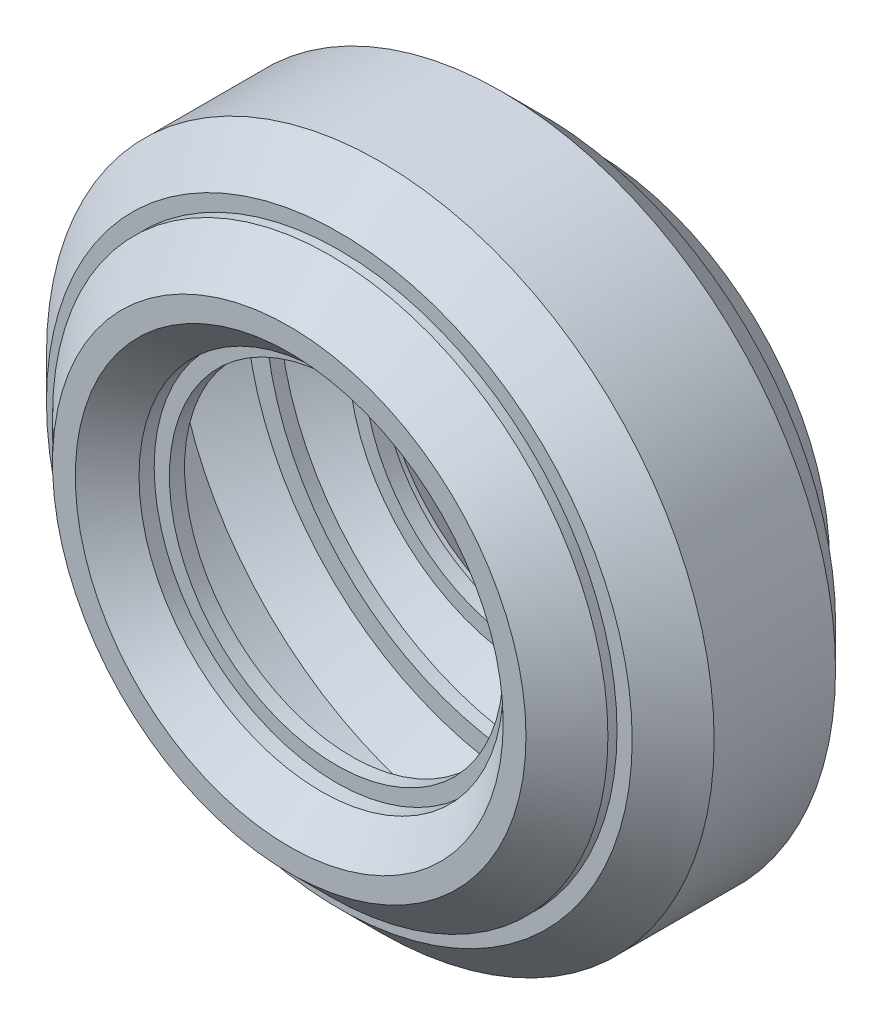
ISO-10303-21;
HEADER;
FILE_DESCRIPTION(('STEP AP214'),'2;1');
FILE_NAME('part.step','',(''),(''),'','','');
FILE_SCHEMA(('AUTOMOTIVE_DESIGN { 1 0 10303 214 1 1 1 1 }'));
ENDSEC;
DATA;
#1=APPLICATION_CONTEXT('core data for automotive mechanical design processes');
#2=APPLICATION_PROTOCOL_DEFINITION('international standard','automotive_design',2000,#1);
#3=PRODUCT_CONTEXT('',#1,'mechanical');
#4=PRODUCT('Part','Part','',(#3));
#5=PRODUCT_RELATED_PRODUCT_CATEGORY('part','',(#4));
#6=PRODUCT_DEFINITION_FORMATION('','',#4);
#7=PRODUCT_DEFINITION_CONTEXT('part definition',#1,'design');
#8=PRODUCT_DEFINITION('design','',#6,#7);
#9=PRODUCT_DEFINITION_SHAPE('','',#8);
#10=(LENGTH_UNIT() NAMED_UNIT(*) SI_UNIT(.MILLI.,.METRE.));
#11=(NAMED_UNIT(*) PLANE_ANGLE_UNIT() SI_UNIT($,.RADIAN.));
#12=(NAMED_UNIT(*) SI_UNIT($,.STERADIAN.) SOLID_ANGLE_UNIT());
#13=UNCERTAINTY_MEASURE_WITH_UNIT(LENGTH_MEASURE(1.E-05),#10,'distance_accuracy_value','');
#14=(GEOMETRIC_REPRESENTATION_CONTEXT(3) GLOBAL_UNCERTAINTY_ASSIGNED_CONTEXT((#13)) GLOBAL_UNIT_ASSIGNED_CONTEXT((#10,
#11,#12)) REPRESENTATION_CONTEXT('',''));
#15=CARTESIAN_POINT('',(0.,0.,0.));
#16=DIRECTION('',(0.,0.,1.));
#17=DIRECTION('',(1.,0.,0.));
#18=AXIS2_PLACEMENT_3D('',#15,#16,#17);
#19=CARTESIAN_POINT('',(21.59,0.,8.763));
#20=DIRECTION('',(0.,0.,1.));
#21=DIRECTION('',(1.,0.,0.));
#22=AXIS2_PLACEMENT_3D('',#19,#20,#21);
#23=PLANE('',#22);
#24=CARTESIAN_POINT('',(7.62,0.,8.763));
#25=DIRECTION('',(0.,0.,1.));
#26=DIRECTION('',(1.,0.,0.));
#27=AXIS2_PLACEMENT_3D('',#24,#25,#26);
#28=CIRCLE('',#27,15.24);
#29=CARTESIAN_POINT('',(22.86,0.,8.763));
#30=VERTEX_POINT('',#29);
#31=EDGE_CURVE('E53',#30,#30,#28,.T.);
#32=ORIENTED_EDGE('',*,*,#31,.T.);
#33=EDGE_LOOP('',(#32));
#34=FACE_BOUND('',#33,.T.);
#35=CARTESIAN_POINT('',(7.62,0.,8.763));
#36=DIRECTION('',(0.,0.,1.));
#37=DIRECTION('',(1.,0.,0.));
#38=AXIS2_PLACEMENT_3D('',#35,#36,#37);
#39=CIRCLE('',#38,13.97);
#40=CARTESIAN_POINT('',(21.59,0.,8.763));
#41=VERTEX_POINT('',#40);
#42=EDGE_CURVE('E11',#41,#41,#39,.T.);
#43=ORIENTED_EDGE('',*,*,#42,.F.);
#44=EDGE_LOOP('',(#43));
#45=FACE_BOUND('',#44,.T.);
#46=ADVANCED_FACE('F33',(#34,#45),#23,.T.);
#47=CARTESIAN_POINT('',(7.62,0.,0.));
#48=DIRECTION('',(0.,0.,1.));
#49=DIRECTION('',(1.,0.,0.));
#50=AXIS2_PLACEMENT_3D('',#47,#48,#49);
#51=CYLINDRICAL_SURFACE('',#50,13.97);
#52=ORIENTED_EDGE('',*,*,#42,.T.);
#53=EDGE_LOOP('',(#52));
#54=FACE_BOUND('',#53,.T.);
#55=CARTESIAN_POINT('',(7.62,0.,7.493));
#56=DIRECTION('',(0.,0.,1.));
#57=DIRECTION('',(1.,0.,0.));
#58=AXIS2_PLACEMENT_3D('',#55,#56,#57);
#59=CIRCLE('',#58,13.97);
#60=CARTESIAN_POINT('',(21.59,0.,7.493));
#61=VERTEX_POINT('',#60);
#62=EDGE_CURVE('E39',#61,#61,#59,.T.);
#63=ORIENTED_EDGE('',*,*,#62,.F.);
#64=EDGE_LOOP('',(#63));
#65=FACE_BOUND('',#64,.T.);
#66=ADVANCED_FACE('F181',(#54,#65),#51,.F.);
#67=CARTESIAN_POINT('',(22.86,0.,7.493));
#68=DIRECTION('',(0.,0.,-1.));
#69=DIRECTION('',(-1.,0.,0.));
#70=AXIS2_PLACEMENT_3D('',#67,#68,#69);
#71=PLANE('',#70);
#72=ORIENTED_EDGE('',*,*,#62,.T.);
#73=EDGE_LOOP('',(#72));
#74=FACE_BOUND('',#73,.T.);
#75=CARTESIAN_POINT('',(7.62,0.,7.493));
#76=DIRECTION('',(0.,0.,1.));
#77=DIRECTION('',(1.,0.,0.));
#78=AXIS2_PLACEMENT_3D('',#75,#76,#77);
#79=CIRCLE('',#78,15.24);
#80=CARTESIAN_POINT('',(22.86,0.,7.493));
#81=VERTEX_POINT('',#80);
#82=EDGE_CURVE('E50',#81,#81,#79,.T.);
#83=ORIENTED_EDGE('',*,*,#82,.F.);
#84=EDGE_LOOP('',(#83));
#85=FACE_BOUND('',#84,.T.);
#86=ADVANCED_FACE('F186',(#74,#85),#71,.T.);
#87=CARTESIAN_POINT('',(21.59,0.,-7.493));
#88=DIRECTION('',(0.,0.,1.));
#89=DIRECTION('',(1.,0.,0.));
#90=AXIS2_PLACEMENT_3D('',#87,#88,#89);
#91=PLANE('',#90);
#92=CARTESIAN_POINT('',(7.62,0.,-7.493));
#93=DIRECTION('',(0.,0.,1.));
#94=DIRECTION('',(1.,0.,0.));
#95=AXIS2_PLACEMENT_3D('',#92,#93,#94);
#96=CIRCLE('',#95,15.24);
#97=CARTESIAN_POINT('',(22.86,0.,-7.493));
#98=VERTEX_POINT('',#97);
#99=EDGE_CURVE('E54',#98,#98,#96,.T.);
#100=ORIENTED_EDGE('',*,*,#99,.T.);
#101=EDGE_LOOP('',(#100));
#102=FACE_BOUND('',#101,.T.);
#103=CARTESIAN_POINT('',(7.62,0.,-7.493));
#104=DIRECTION('',(0.,0.,1.));
#105=DIRECTION('',(1.,0.,0.));
#106=AXIS2_PLACEMENT_3D('',#103,#104,#105);
#107=CIRCLE('',#106,13.97);
#108=CARTESIAN_POINT('',(21.59,0.,-7.493));
#109=VERTEX_POINT('',#108);
#110=EDGE_CURVE('E43',#109,#109,#107,.T.);
#111=ORIENTED_EDGE('',*,*,#110,.F.);
#112=EDGE_LOOP('',(#111));
#113=FACE_BOUND('',#112,.T.);
#114=ADVANCED_FACE('F261',(#102,#113),#91,.T.);
#115=CARTESIAN_POINT('',(7.62,0.,0.));
#116=DIRECTION('',(0.,0.,1.));
#117=DIRECTION('',(1.,0.,0.));
#118=AXIS2_PLACEMENT_3D('',#115,#116,#117);
#119=CYLINDRICAL_SURFACE('',#118,13.97);
#120=ORIENTED_EDGE('',*,*,#110,.T.);
#121=EDGE_LOOP('',(#120));
#122=FACE_BOUND('',#121,.T.);
#123=CARTESIAN_POINT('',(7.62,0.,-8.763));
#124=DIRECTION('',(0.,0.,1.));
#125=DIRECTION('',(1.,0.,0.));
#126=AXIS2_PLACEMENT_3D('',#123,#124,#125);
#127=CIRCLE('',#126,13.97);
#128=CARTESIAN_POINT('',(21.59,0.,-8.763));
#129=VERTEX_POINT('',#128);
#130=EDGE_CURVE('E47',#129,#129,#127,.T.);
#131=ORIENTED_EDGE('',*,*,#130,.F.);
#132=EDGE_LOOP('',(#131));
#133=FACE_BOUND('',#132,.T.);
#134=ADVANCED_FACE('F257',(#122,#133),#119,.F.);
#135=CARTESIAN_POINT('',(22.86,0.,-8.763));
#136=DIRECTION('',(0.,0.,-1.));
#137=DIRECTION('',(-1.,0.,0.));
#138=AXIS2_PLACEMENT_3D('',#135,#136,#137);
#139=PLANE('',#138);
#140=ORIENTED_EDGE('',*,*,#130,.T.);
#141=EDGE_LOOP('',(#140));
#142=FACE_BOUND('',#141,.T.);
#143=CARTESIAN_POINT('',(7.62,0.,-8.763));
#144=DIRECTION('',(0.,0.,1.));
#145=DIRECTION('',(1.,0.,0.));
#146=AXIS2_PLACEMENT_3D('',#143,#144,#145);
#147=CIRCLE('',#146,15.24);
#148=CARTESIAN_POINT('',(22.86,0.,-8.763));
#149=VERTEX_POINT('',#148);
#150=EDGE_CURVE('E60',#149,#149,#147,.T.);
#151=ORIENTED_EDGE('',*,*,#150,.F.);
#152=EDGE_LOOP('',(#151));
#153=FACE_BOUND('',#152,.T.);
#154=ADVANCED_FACE('F253',(#142,#153),#139,.T.);
#155=CARTESIAN_POINT('',(7.62,0.,0.));
#156=DIRECTION('',(0.,0.,1.));
#157=DIRECTION('',(1.,0.,0.));
#158=AXIS2_PLACEMENT_3D('',#155,#156,#157);
#159=CYLINDRICAL_SURFACE('',#158,15.24);
#160=ORIENTED_EDGE('',*,*,#150,.T.);
#161=EDGE_LOOP('',(#160));
#162=FACE_BOUND('',#161,.T.);
#163=CARTESIAN_POINT('',(7.62,0.,-10.033));
#164=DIRECTION('',(0.,0.,1.));
#165=DIRECTION('',(1.,0.,0.));
#166=AXIS2_PLACEMENT_3D('',#163,#164,#165);
#167=CIRCLE('',#166,15.24);
#168=CARTESIAN_POINT('',(22.86,0.,-10.033));
#169=VERTEX_POINT('',#168);
#170=EDGE_CURVE('E63',#169,#169,#167,.T.);
#171=ORIENTED_EDGE('',*,*,#170,.F.);
#172=EDGE_LOOP('',(#171));
#173=FACE_BOUND('',#172,.T.);
#174=ADVANCED_FACE('F249',(#162,#173),#159,.F.);
#175=CARTESIAN_POINT('',(7.62,0.,-12.7));
#176=DIRECTION('',(0.,0.,-1.));
#177=DIRECTION('',(-1.,0.,0.));
#178=AXIS2_PLACEMENT_3D('',#175,#176,#177);
#179=CONICAL_SURFACE('',#178,17.9069999999999,0.785398163397436);
#180=ORIENTED_EDGE('',*,*,#170,.T.);
#181=EDGE_LOOP('',(#180));
#182=FACE_BOUND('',#181,.T.);
#183=CARTESIAN_POINT('',(7.62,0.,-12.7));
#184=DIRECTION('',(0.,0.,1.));
#185=DIRECTION('',(1.,0.,0.));
#186=AXIS2_PLACEMENT_3D('',#183,#184,#185);
#187=CIRCLE('',#186,17.9069999999999);
#188=CARTESIAN_POINT('',(25.5269999999999,0.,-12.7));
#189=VERTEX_POINT('',#188);
#190=EDGE_CURVE('E66',#189,#189,#187,.T.);
#191=ORIENTED_EDGE('',*,*,#190,.F.);
#192=EDGE_LOOP('',(#191));
#193=FACE_BOUND('',#192,.T.);
#194=ADVANCED_FACE('F245',(#182,#193),#179,.F.);
#195=CARTESIAN_POINT('',(25.5269999999999,0.,-12.7));
#196=DIRECTION('',(0.,0.,-1.));
#197=DIRECTION('',(-1.,0.,0.));
#198=AXIS2_PLACEMENT_3D('',#195,#196,#197);
#199=PLANE('',#198);
#200=ORIENTED_EDGE('',*,*,#190,.T.);
#201=EDGE_LOOP('',(#200));
#202=FACE_BOUND('',#201,.T.);
#203=CARTESIAN_POINT('',(7.62,0.,-12.7));
#204=DIRECTION('',(0.,0.,1.));
#205=DIRECTION('',(1.,0.,0.));
#206=AXIS2_PLACEMENT_3D('',#203,#204,#205);
#207=CIRCLE('',#206,19.8119999999999);
#208=CARTESIAN_POINT('',(27.4319999999999,0.,-12.7));
#209=VERTEX_POINT('',#208);
#210=EDGE_CURVE('E69',#209,#209,#207,.T.);
#211=ORIENTED_EDGE('',*,*,#210,.F.);
#212=EDGE_LOOP('',(#211));
#213=FACE_BOUND('',#212,.T.);
#214=ADVANCED_FACE('F241',(#202,#213),#199,.T.);
#215=CARTESIAN_POINT('',(7.62,0.,-9.27099999999992));
#216=DIRECTION('',(0.,0.,1.));
#217=DIRECTION('',(1.,0.,0.));
#218=AXIS2_PLACEMENT_3D('',#215,#216,#217);
#219=CONICAL_SURFACE('',#218,23.2409999999999,0.785398163397437);
#220=ORIENTED_EDGE('',*,*,#210,.T.);
#221=EDGE_LOOP('',(#220));
#222=FACE_BOUND('',#221,.T.);
#223=CARTESIAN_POINT('',(7.62,0.,-9.27099999999992));
#224=DIRECTION('',(0.,0.,1.));
#225=DIRECTION('',(1.,0.,0.));
#226=AXIS2_PLACEMENT_3D('',#223,#224,#225);
#227=CIRCLE('',#226,23.2409999999999);
#228=CARTESIAN_POINT('',(30.8609999999999,0.,-9.27099999999992));
#229=VERTEX_POINT('',#228);
#230=EDGE_CURVE('E72',#229,#229,#227,.T.);
#231=ORIENTED_EDGE('',*,*,#230,.F.);
#232=EDGE_LOOP('',(#231));
#233=FACE_BOUND('',#232,.T.);
#234=ADVANCED_FACE('F237',(#222,#233),#219,.T.);
#235=CARTESIAN_POINT('',(7.62,0.,0.));
#236=DIRECTION('',(0.,0.,1.));
#237=DIRECTION('',(1.,0.,0.));
#238=AXIS2_PLACEMENT_3D('',#235,#236,#237);
#239=CYLINDRICAL_SURFACE('',#238,23.2409999999999);
#240=ORIENTED_EDGE('',*,*,#230,.T.);
#241=EDGE_LOOP('',(#240));
#242=FACE_BOUND('',#241,.T.);
#243=CARTESIAN_POINT('',(7.62,0.,-8.50899999999999));
#244=DIRECTION('',(0.,0.,1.));
#245=DIRECTION('',(1.,0.,0.));
#246=AXIS2_PLACEMENT_3D('',#243,#244,#245);
#247=CIRCLE('',#246,23.2409999999999);
#248=CARTESIAN_POINT('',(30.8609999999999,0.,-8.50899999999999));
#249=VERTEX_POINT('',#248);
#250=EDGE_CURVE('E75',#249,#249,#247,.T.);
#251=ORIENTED_EDGE('',*,*,#250,.F.);
#252=EDGE_LOOP('',(#251));
#253=FACE_BOUND('',#252,.T.);
#254=ADVANCED_FACE('F233',(#242,#253),#239,.T.);
#255=CARTESIAN_POINT('',(30.8609999999999,0.,-8.50899999999999));
#256=DIRECTION('',(0.,0.,-1.));
#257=DIRECTION('',(-1.,0.,0.));
#258=AXIS2_PLACEMENT_3D('',#255,#256,#257);
#259=PLANE('',#258);
#260=ORIENTED_EDGE('',*,*,#250,.T.);
#261=EDGE_LOOP('',(#260));
#262=FACE_BOUND('',#261,.T.);
#263=CARTESIAN_POINT('',(7.62,0.,-8.50899999999999));
#264=DIRECTION('',(0.,0.,1.));
#265=DIRECTION('',(1.,0.,0.));
#266=AXIS2_PLACEMENT_3D('',#263,#264,#265);
#267=CIRCLE('',#266,24.5109999999999);
#268=CARTESIAN_POINT('',(32.1309999999999,0.,-8.50899999999999));
#269=VERTEX_POINT('',#268);
#270=EDGE_CURVE('E78',#269,#269,#267,.T.);
#271=ORIENTED_EDGE('',*,*,#270,.F.);
#272=EDGE_LOOP('',(#271));
#273=FACE_BOUND('',#272,.T.);
#274=ADVANCED_FACE('F229',(#262,#273),#259,.T.);
#275=CARTESIAN_POINT('',(7.62,0.,-5.08));
#276=DIRECTION('',(0.,0.,1.));
#277=DIRECTION('',(1.,0.,0.));
#278=AXIS2_PLACEMENT_3D('',#275,#276,#277);
#279=CONICAL_SURFACE('',#278,27.94,0.785398163397461);
#280=ORIENTED_EDGE('',*,*,#270,.T.);
#281=EDGE_LOOP('',(#280));
#282=FACE_BOUND('',#281,.T.);
#283=CARTESIAN_POINT('',(7.62,0.,-5.08));
#284=DIRECTION('',(0.,0.,1.));
#285=DIRECTION('',(1.,0.,0.));
#286=AXIS2_PLACEMENT_3D('',#283,#284,#285);
#287=CIRCLE('',#286,27.94);
#288=CARTESIAN_POINT('',(35.56,0.,-5.08));
#289=VERTEX_POINT('',#288);
#290=EDGE_CURVE('E81',#289,#289,#287,.T.);
#291=ORIENTED_EDGE('',*,*,#290,.F.);
#292=EDGE_LOOP('',(#291));
#293=FACE_BOUND('',#292,.T.);
#294=ADVANCED_FACE('F225',(#282,#293),#279,.T.);
#295=CARTESIAN_POINT('',(7.62,0.,0.));
#296=DIRECTION('',(0.,0.,1.));
#297=DIRECTION('',(1.,0.,0.));
#298=AXIS2_PLACEMENT_3D('',#295,#296,#297);
#299=CYLINDRICAL_SURFACE('',#298,27.94);
#300=ORIENTED_EDGE('',*,*,#290,.T.);
#301=EDGE_LOOP('',(#300));
#302=FACE_BOUND('',#301,.T.);
#303=CARTESIAN_POINT('',(7.62,0.,5.08));
#304=DIRECTION('',(0.,0.,1.));
#305=DIRECTION('',(1.,0.,0.));
#306=AXIS2_PLACEMENT_3D('',#303,#304,#305);
#307=CIRCLE('',#306,27.94);
#308=CARTESIAN_POINT('',(35.56,0.,5.08));
#309=VERTEX_POINT('',#308);
#310=EDGE_CURVE('E84',#309,#309,#307,.T.);
#311=ORIENTED_EDGE('',*,*,#310,.F.);
#312=EDGE_LOOP('',(#311));
#313=FACE_BOUND('',#312,.T.);
#314=ADVANCED_FACE('F221',(#302,#313),#299,.T.);
#315=CARTESIAN_POINT('',(7.62,0.,8.50899999999999));
#316=DIRECTION('',(0.,0.,-1.));
#317=DIRECTION('',(-1.,0.,0.));
#318=AXIS2_PLACEMENT_3D('',#315,#316,#317);
#319=CONICAL_SURFACE('',#318,24.5109999999999,0.78539816339746);
#320=ORIENTED_EDGE('',*,*,#310,.T.);
#321=EDGE_LOOP('',(#320));
#322=FACE_BOUND('',#321,.T.);
#323=CARTESIAN_POINT('',(7.62,0.,8.50899999999999));
#324=DIRECTION('',(0.,0.,1.));
#325=DIRECTION('',(1.,0.,0.));
#326=AXIS2_PLACEMENT_3D('',#323,#324,#325);
#327=CIRCLE('',#326,24.5109999999999);
#328=CARTESIAN_POINT('',(32.1309999999999,0.,8.50899999999999));
#329=VERTEX_POINT('',#328);
#330=EDGE_CURVE('E87',#329,#329,#327,.T.);
#331=ORIENTED_EDGE('',*,*,#330,.F.);
#332=EDGE_LOOP('',(#331));
#333=FACE_BOUND('',#332,.T.);
#334=ADVANCED_FACE('F217',(#322,#333),#319,.T.);
#335=CARTESIAN_POINT('',(32.1309999999999,0.,8.50899999999999));
#336=DIRECTION('',(0.,0.,1.));
#337=DIRECTION('',(1.,0.,0.));
#338=AXIS2_PLACEMENT_3D('',#335,#336,#337);
#339=PLANE('',#338);
#340=ORIENTED_EDGE('',*,*,#330,.T.);
#341=EDGE_LOOP('',(#340));
#342=FACE_BOUND('',#341,.T.);
#343=CARTESIAN_POINT('',(7.62,0.,8.50899999999999));
#344=DIRECTION('',(0.,0.,1.));
#345=DIRECTION('',(1.,0.,0.));
#346=AXIS2_PLACEMENT_3D('',#343,#344,#345);
#347=CIRCLE('',#346,23.2409999999999);
#348=CARTESIAN_POINT('',(30.8609999999999,0.,8.50899999999999));
#349=VERTEX_POINT('',#348);
#350=EDGE_CURVE('E90',#349,#349,#347,.T.);
#351=ORIENTED_EDGE('',*,*,#350,.F.);
#352=EDGE_LOOP('',(#351));
#353=FACE_BOUND('',#352,.T.);
#354=ADVANCED_FACE('F213',(#342,#353),#339,.T.);
#355=CARTESIAN_POINT('',(7.62,0.,0.));
#356=DIRECTION('',(0.,0.,1.));
#357=DIRECTION('',(1.,0.,0.));
#358=AXIS2_PLACEMENT_3D('',#355,#356,#357);
#359=CYLINDRICAL_SURFACE('',#358,23.2409999999999);
#360=ORIENTED_EDGE('',*,*,#350,.T.);
#361=EDGE_LOOP('',(#360));
#362=FACE_BOUND('',#361,.T.);
#363=CARTESIAN_POINT('',(7.62,0.,9.27099999999992));
#364=DIRECTION('',(0.,0.,1.));
#365=DIRECTION('',(1.,0.,0.));
#366=AXIS2_PLACEMENT_3D('',#363,#364,#365);
#367=CIRCLE('',#366,23.2409999999999);
#368=CARTESIAN_POINT('',(30.8609999999999,0.,9.27099999999992));
#369=VERTEX_POINT('',#368);
#370=EDGE_CURVE('E93',#369,#369,#367,.T.);
#371=ORIENTED_EDGE('',*,*,#370,.F.);
#372=EDGE_LOOP('',(#371));
#373=FACE_BOUND('',#372,.T.);
#374=ADVANCED_FACE('F209',(#362,#373),#359,.T.);
#375=CARTESIAN_POINT('',(7.62,0.,12.7));
#376=DIRECTION('',(0.,0.,-1.));
#377=DIRECTION('',(-1.,0.,0.));
#378=AXIS2_PLACEMENT_3D('',#375,#376,#377);
#379=CONICAL_SURFACE('',#378,19.8119999999999,0.785398163397437);
#380=ORIENTED_EDGE('',*,*,#370,.T.);
#381=EDGE_LOOP('',(#380));
#382=FACE_BOUND('',#381,.T.);
#383=CARTESIAN_POINT('',(7.62,0.,12.7));
#384=DIRECTION('',(0.,0.,1.));
#385=DIRECTION('',(1.,0.,0.));
#386=AXIS2_PLACEMENT_3D('',#383,#384,#385);
#387=CIRCLE('',#386,19.8119999999999);
#388=CARTESIAN_POINT('',(27.4319999999999,0.,12.7));
#389=VERTEX_POINT('',#388);
#390=EDGE_CURVE('E96',#389,#389,#387,.T.);
#391=ORIENTED_EDGE('',*,*,#390,.F.);
#392=EDGE_LOOP('',(#391));
#393=FACE_BOUND('',#392,.T.);
#394=ADVANCED_FACE('F205',(#382,#393),#379,.T.);
#395=CARTESIAN_POINT('',(27.4319999999999,0.,12.7));
#396=DIRECTION('',(0.,0.,1.));
#397=DIRECTION('',(1.,0.,0.));
#398=AXIS2_PLACEMENT_3D('',#395,#396,#397);
#399=PLANE('',#398);
#400=ORIENTED_EDGE('',*,*,#390,.T.);
#401=EDGE_LOOP('',(#400));
#402=FACE_BOUND('',#401,.T.);
#403=CARTESIAN_POINT('',(7.62,0.,12.7));
#404=DIRECTION('',(0.,0.,1.));
#405=DIRECTION('',(1.,0.,0.));
#406=AXIS2_PLACEMENT_3D('',#403,#404,#405);
#407=CIRCLE('',#406,17.907);
#408=CARTESIAN_POINT('',(25.527,0.,12.7));
#409=VERTEX_POINT('',#408);
#410=EDGE_CURVE('E99',#409,#409,#407,.T.);
#411=ORIENTED_EDGE('',*,*,#410,.F.);
#412=EDGE_LOOP('',(#411));
#413=FACE_BOUND('',#412,.T.);
#414=ADVANCED_FACE('F197',(#402,#413),#399,.T.);
#415=CARTESIAN_POINT('',(7.62,0.,10.033));
#416=DIRECTION('',(0.,0.,1.));
#417=DIRECTION('',(1.,0.,0.));
#418=AXIS2_PLACEMENT_3D('',#415,#416,#417);
#419=CONICAL_SURFACE('',#418,15.24,0.785398163397443);
#420=ORIENTED_EDGE('',*,*,#410,.T.);
#421=EDGE_LOOP('',(#420));
#422=FACE_BOUND('',#421,.T.);
#423=CARTESIAN_POINT('',(7.62,0.,10.033));
#424=DIRECTION('',(0.,0.,1.));
#425=DIRECTION('',(1.,0.,0.));
#426=AXIS2_PLACEMENT_3D('',#423,#424,#425);
#427=CIRCLE('',#426,15.24);
#428=CARTESIAN_POINT('',(22.86,0.,10.033));
#429=VERTEX_POINT('',#428);
#430=EDGE_CURVE('E102',#429,#429,#427,.T.);
#431=ORIENTED_EDGE('',*,*,#430,.F.);
#432=EDGE_LOOP('',(#431));
#433=FACE_BOUND('',#432,.T.);
#434=ADVANCED_FACE('F191',(#422,#433),#419,.F.);
#435=CARTESIAN_POINT('',(7.62,0.,0.));
#436=DIRECTION('',(0.,0.,1.));
#437=DIRECTION('',(1.,0.,0.));
#438=AXIS2_PLACEMENT_3D('',#435,#436,#437);
#439=CYLINDRICAL_SURFACE('',#438,15.24);
#440=ORIENTED_EDGE('',*,*,#430,.T.);
#441=EDGE_LOOP('',(#440));
#442=FACE_BOUND('',#441,.T.);
#443=ORIENTED_EDGE('',*,*,#31,.F.);
#444=EDGE_LOOP('',(#443));
#445=FACE_BOUND('',#444,.T.);
#446=ADVANCED_FACE('F176',(#442,#445),#439,.F.);
#447=CARTESIAN_POINT('',(7.62,0.,0.));
#448=DIRECTION('',(0.,0.,1.));
#449=DIRECTION('',(1.,0.,0.));
#450=AXIS2_PLACEMENT_3D('',#447,#448,#449);
#451=CYLINDRICAL_SURFACE('',#450,15.24);
#452=CARTESIAN_POINT('',(7.62,0.,-8.128));
#453=DIRECTION('',(0.,0.,1.));
#454=DIRECTION('',(1.,0.,0.));
#455=AXIS2_PLACEMENT_3D('',#452,#453,#454);
#456=CIRCLE('',#455,15.24);
#457=CARTESIAN_POINT('',(22.86,0.,-8.128));
#458=VERTEX_POINT('',#457);
#459=EDGE_CURVE('E107',#458,#458,#456,.T.);
#460=ORIENTED_EDGE('',*,*,#459,.T.);
#461=EDGE_LOOP('',(#460));
#462=FACE_BOUND('',#461,.T.);
#463=ORIENTED_EDGE('',*,*,#99,.F.);
#464=EDGE_LOOP('',(#463));
#465=FACE_BOUND('',#464,.T.);
#466=ADVANCED_FACE('F166',(#462,#465),#451,.T.);
#467=CARTESIAN_POINT('',(21.59,0.,8.128));
#468=DIRECTION('',(0.,0.,1.));
#469=DIRECTION('',(1.,0.,0.));
#470=AXIS2_PLACEMENT_3D('',#467,#468,#469);
#471=PLANE('',#470);
#472=CARTESIAN_POINT('',(7.62,0.,8.128));
#473=DIRECTION('',(0.,0.,-1.));
#474=DIRECTION('',(-1.,0.,0.));
#475=AXIS2_PLACEMENT_3D('',#472,#473,#474);
#476=CIRCLE('',#475,15.24);
#477=CARTESIAN_POINT('',(-7.62,0.,8.128));
#478=VERTEX_POINT('',#477);
#479=EDGE_CURVE('E56',#478,#478,#476,.F.);
#480=ORIENTED_EDGE('',*,*,#479,.T.);
#481=EDGE_LOOP('',(#480));
#482=FACE_BOUND('',#481,.T.);
#483=CARTESIAN_POINT('',(7.62,0.,8.128));
#484=DIRECTION('',(0.,0.,1.));
#485=DIRECTION('',(1.,0.,0.));
#486=AXIS2_PLACEMENT_3D('',#483,#484,#485);
#487=CIRCLE('',#486,15.875);
#488=CARTESIAN_POINT('',(23.495,0.,8.128));
#489=VERTEX_POINT('',#488);
#490=EDGE_CURVE('E157',#489,#489,#487,.T.);
#491=ORIENTED_EDGE('',*,*,#490,.F.);
#492=EDGE_LOOP('',(#491));
#493=FACE_BOUND('',#492,.T.);
#494=ADVANCED_FACE('F163',(#482,#493),#471,.F.);
#495=CARTESIAN_POINT('',(7.62,0.,0.));
#496=DIRECTION('',(0.,0.,1.));
#497=DIRECTION('',(1.,0.,0.));
#498=AXIS2_PLACEMENT_3D('',#495,#496,#497);
#499=CYLINDRICAL_SURFACE('',#498,15.24);
#500=ORIENTED_EDGE('',*,*,#82,.T.);
#501=EDGE_LOOP('',(#500));
#502=FACE_BOUND('',#501,.T.);
#503=ORIENTED_EDGE('',*,*,#479,.F.);
#504=EDGE_LOOP('',(#503));
#505=FACE_BOUND('',#504,.T.);
#506=ADVANCED_FACE('F165',(#502,#505),#499,.T.);
#507=CARTESIAN_POINT('',(22.86,0.,-8.128));
#508=DIRECTION('',(0.,0.,-1.));
#509=DIRECTION('',(-1.,0.,0.));
#510=AXIS2_PLACEMENT_3D('',#507,#508,#509);
#511=PLANE('',#510);
#512=ORIENTED_EDGE('',*,*,#459,.F.);
#513=EDGE_LOOP('',(#512));
#514=FACE_BOUND('',#513,.T.);
#515=CARTESIAN_POINT('',(7.62,0.,-8.128));
#516=DIRECTION('',(0.,0.,-1.));
#517=DIRECTION('',(-1.,0.,0.));
#518=AXIS2_PLACEMENT_3D('',#515,#516,#517);
#519=CIRCLE('',#518,15.875);
#520=CARTESIAN_POINT('',(-8.255,0.,-8.128));
#521=VERTEX_POINT('',#520);
#522=EDGE_CURVE('E110',#521,#521,#519,.F.);
#523=ORIENTED_EDGE('',*,*,#522,.T.);
#524=EDGE_LOOP('',(#523));
#525=FACE_BOUND('',#524,.T.);
#526=ADVANCED_FACE('F173',(#514,#525),#511,.F.);
#527=CARTESIAN_POINT('',(7.62,0.,0.));
#528=DIRECTION('',(0.,0.,1.));
#529=DIRECTION('',(1.,0.,0.));
#530=AXIS2_PLACEMENT_3D('',#527,#528,#529);
#531=CYLINDRICAL_SURFACE('',#530,15.875);
#532=ORIENTED_EDGE('',*,*,#522,.F.);
#533=EDGE_LOOP('',(#532));
#534=FACE_BOUND('',#533,.T.);
#535=CARTESIAN_POINT('',(7.62,0.,-9.76997438789309));
#536=DIRECTION('',(0.,0.,-1.));
#537=DIRECTION('',(-1.,0.,0.));
#538=AXIS2_PLACEMENT_3D('',#535,#536,#537);
#539=CIRCLE('',#538,15.875);
#540=CARTESIAN_POINT('',(-8.255,0.,-9.76997438789309));
#541=VERTEX_POINT('',#540);
#542=EDGE_CURVE('E115',#541,#541,#539,.F.);
#543=ORIENTED_EDGE('',*,*,#542,.T.);
#544=EDGE_LOOP('',(#543));
#545=FACE_BOUND('',#544,.T.);
#546=ADVANCED_FACE('F372',(#534,#545),#531,.T.);
#547=CARTESIAN_POINT('',(7.62,0.,-12.2509871939465));
#548=DIRECTION('',(0.,0.,-1.));
#549=DIRECTION('',(-1.,0.,0.));
#550=AXIS2_PLACEMENT_3D('',#547,#548,#549);
#551=CONICAL_SURFACE('',#550,18.3560128060534,0.785398163397436);
#552=ORIENTED_EDGE('',*,*,#542,.F.);
#553=EDGE_LOOP('',(#552));
#554=FACE_BOUND('',#553,.T.);
#555=CARTESIAN_POINT('',(7.62,0.,-12.065));
#556=DIRECTION('',(0.,0.,-1.));
#557=DIRECTION('',(-1.,0.,0.));
#558=AXIS2_PLACEMENT_3D('',#555,#556,#557);
#559=CIRCLE('',#558,18.1700256121068);
#560=CARTESIAN_POINT('',(-10.5500256121068,0.,-12.065));
#561=VERTEX_POINT('',#560);
#562=EDGE_CURVE('E118',#561,#561,#559,.F.);
#563=ORIENTED_EDGE('',*,*,#562,.T.);
#564=EDGE_LOOP('',(#563));
#565=FACE_BOUND('',#564,.T.);
#566=ADVANCED_FACE('F381',(#554,#565),#551,.T.);
#567=CARTESIAN_POINT('',(25.5269999999999,0.,-12.065));
#568=DIRECTION('',(0.,0.,-1.));
#569=DIRECTION('',(-1.,0.,0.));
#570=AXIS2_PLACEMENT_3D('',#567,#568,#569);
#571=PLANE('',#570);
#572=ORIENTED_EDGE('',*,*,#562,.F.);
#573=EDGE_LOOP('',(#572));
#574=FACE_BOUND('',#573,.T.);
#575=CARTESIAN_POINT('',(7.62,0.,-12.065));
#576=DIRECTION('',(0.,0.,-1.));
#577=DIRECTION('',(-1.,0.,0.));
#578=AXIS2_PLACEMENT_3D('',#575,#576,#577);
#579=CIRCLE('',#578,19.548974387893);
#580=CARTESIAN_POINT('',(-11.928974387893,0.,-12.065));
#581=VERTEX_POINT('',#580);
#582=EDGE_CURVE('E121',#581,#581,#579,.F.);
#583=ORIENTED_EDGE('',*,*,#582,.T.);
#584=EDGE_LOOP('',(#583));
#585=FACE_BOUND('',#584,.T.);
#586=ADVANCED_FACE('F391',(#574,#585),#571,.F.);
#587=CARTESIAN_POINT('',(7.62,0.,-8.82198719394647));
#588=DIRECTION('',(0.,0.,1.));
#589=DIRECTION('',(1.,0.,0.));
#590=AXIS2_PLACEMENT_3D('',#587,#588,#589);
#591=CONICAL_SURFACE('',#590,22.7919871939465,0.785398163397437);
#592=ORIENTED_EDGE('',*,*,#582,.F.);
#593=EDGE_LOOP('',(#592));
#594=FACE_BOUND('',#593,.T.);
#595=CARTESIAN_POINT('',(7.62,0.,-9.00797438789301));
#596=DIRECTION('',(0.,0.,1.));
#597=DIRECTION('',(1.,0.,0.));
#598=AXIS2_PLACEMENT_3D('',#595,#596,#597);
#599=CIRCLE('',#598,22.6059999999999);
#600=CARTESIAN_POINT('',(30.2259999999999,0.,-9.00797438789301));
#601=VERTEX_POINT('',#600);
#602=EDGE_CURVE('E124',#601,#601,#599,.T.);
#603=ORIENTED_EDGE('',*,*,#602,.T.);
#604=EDGE_LOOP('',(#603));
#605=FACE_BOUND('',#604,.T.);
#606=ADVANCED_FACE('F401',(#594,#605),#591,.F.);
#607=CARTESIAN_POINT('',(7.62,0.,0.));
#608=DIRECTION('',(0.,0.,1.));
#609=DIRECTION('',(1.,0.,0.));
#610=AXIS2_PLACEMENT_3D('',#607,#608,#609);
#611=CYLINDRICAL_SURFACE('',#610,22.6059999999999);
#612=ORIENTED_EDGE('',*,*,#602,.F.);
#613=EDGE_LOOP('',(#612));
#614=FACE_BOUND('',#613,.T.);
#615=CARTESIAN_POINT('',(7.62,0.,-7.87399999999999));
#616=DIRECTION('',(0.,0.,-1.));
#617=DIRECTION('',(-1.,0.,0.));
#618=AXIS2_PLACEMENT_3D('',#615,#616,#617);
#619=CIRCLE('',#618,22.6059999999999);
#620=CARTESIAN_POINT('',(-14.9859999999999,0.,-7.87399999999999));
#621=VERTEX_POINT('',#620);
#622=EDGE_CURVE('E127',#621,#621,#619,.F.);
#623=ORIENTED_EDGE('',*,*,#622,.T.);
#624=EDGE_LOOP('',(#623));
#625=FACE_BOUND('',#624,.T.);
#626=ADVANCED_FACE('F411',(#614,#625),#611,.F.);
#627=CARTESIAN_POINT('',(30.8609999999999,0.,-7.87399999999999));
#628=DIRECTION('',(0.,0.,-1.));
#629=DIRECTION('',(-1.,0.,0.));
#630=AXIS2_PLACEMENT_3D('',#627,#628,#629);
#631=PLANE('',#630);
#632=ORIENTED_EDGE('',*,*,#622,.F.);
#633=EDGE_LOOP('',(#632));
#634=FACE_BOUND('',#633,.T.);
#635=CARTESIAN_POINT('',(7.62,0.,-7.87399999999999));
#636=DIRECTION('',(0.,0.,-1.));
#637=DIRECTION('',(-1.,0.,0.));
#638=AXIS2_PLACEMENT_3D('',#635,#636,#637);
#639=CIRCLE('',#638,24.247974387893);
#640=CARTESIAN_POINT('',(-16.627974387893,0.,-7.87399999999999));
#641=VERTEX_POINT('',#640);
#642=EDGE_CURVE('E130',#641,#641,#639,.F.);
#643=ORIENTED_EDGE('',*,*,#642,.T.);
#644=EDGE_LOOP('',(#643));
#645=FACE_BOUND('',#644,.T.);
#646=ADVANCED_FACE('F421',(#634,#645),#631,.F.);
#647=CARTESIAN_POINT('',(7.62,0.,-4.63098719394654));
#648=DIRECTION('',(0.,0.,1.));
#649=DIRECTION('',(1.,0.,0.));
#650=AXIS2_PLACEMENT_3D('',#647,#648,#649);
#651=CONICAL_SURFACE('',#650,27.4909871939466,0.785398163397461);
#652=ORIENTED_EDGE('',*,*,#642,.F.);
#653=EDGE_LOOP('',(#652));
#654=FACE_BOUND('',#653,.T.);
#655=CARTESIAN_POINT('',(7.62,0.,-4.81697438789308));
#656=DIRECTION('',(0.,0.,1.));
#657=DIRECTION('',(1.,0.,0.));
#658=AXIS2_PLACEMENT_3D('',#655,#656,#657);
#659=CIRCLE('',#658,27.305);
#660=CARTESIAN_POINT('',(34.925,0.,-4.81697438789308));
#661=VERTEX_POINT('',#660);
#662=EDGE_CURVE('E133',#661,#661,#659,.T.);
#663=ORIENTED_EDGE('',*,*,#662,.T.);
#664=EDGE_LOOP('',(#663));
#665=FACE_BOUND('',#664,.T.);
#666=ADVANCED_FACE('F431',(#654,#665),#651,.F.);
#667=CARTESIAN_POINT('',(7.62,0.,0.));
#668=DIRECTION('',(0.,0.,1.));
#669=DIRECTION('',(1.,0.,0.));
#670=AXIS2_PLACEMENT_3D('',#667,#668,#669);
#671=CYLINDRICAL_SURFACE('',#670,27.305);
#672=ORIENTED_EDGE('',*,*,#662,.F.);
#673=EDGE_LOOP('',(#672));
#674=FACE_BOUND('',#673,.T.);
#675=CARTESIAN_POINT('',(7.62,0.,4.81697438789308));
#676=DIRECTION('',(0.,0.,-1.));
#677=DIRECTION('',(-1.,0.,0.));
#678=AXIS2_PLACEMENT_3D('',#675,#676,#677);
#679=CIRCLE('',#678,27.305);
#680=CARTESIAN_POINT('',(-19.685,0.,4.81697438789308));
#681=VERTEX_POINT('',#680);
#682=EDGE_CURVE('E136',#681,#681,#679,.F.);
#683=ORIENTED_EDGE('',*,*,#682,.T.);
#684=EDGE_LOOP('',(#683));
#685=FACE_BOUND('',#684,.T.);
#686=ADVANCED_FACE('F441',(#674,#685),#671,.F.);
#687=CARTESIAN_POINT('',(7.62,0.,8.05998719394653));
#688=DIRECTION('',(0.,0.,-1.));
#689=DIRECTION('',(-1.,0.,0.));
#690=AXIS2_PLACEMENT_3D('',#687,#688,#689);
#691=CONICAL_SURFACE('',#690,24.0619871939465,0.78539816339746);
#692=ORIENTED_EDGE('',*,*,#682,.F.);
#693=EDGE_LOOP('',(#692));
#694=FACE_BOUND('',#693,.T.);
#695=CARTESIAN_POINT('',(7.62,0.,7.87399999999999));
#696=DIRECTION('',(0.,0.,1.));
#697=DIRECTION('',(1.,0.,0.));
#698=AXIS2_PLACEMENT_3D('',#695,#696,#697);
#699=CIRCLE('',#698,24.247974387893);
#700=CARTESIAN_POINT('',(31.867974387893,0.,7.87399999999999));
#701=VERTEX_POINT('',#700);
#702=EDGE_CURVE('E139',#701,#701,#699,.T.);
#703=ORIENTED_EDGE('',*,*,#702,.T.);
#704=EDGE_LOOP('',(#703));
#705=FACE_BOUND('',#704,.T.);
#706=ADVANCED_FACE('F451',(#694,#705),#691,.F.);
#707=CARTESIAN_POINT('',(32.1309999999999,0.,7.87399999999999));
#708=DIRECTION('',(0.,0.,1.));
#709=DIRECTION('',(1.,0.,0.));
#710=AXIS2_PLACEMENT_3D('',#707,#708,#709);
#711=PLANE('',#710);
#712=ORIENTED_EDGE('',*,*,#702,.F.);
#713=EDGE_LOOP('',(#712));
#714=FACE_BOUND('',#713,.T.);
#715=CARTESIAN_POINT('',(7.62,0.,7.87399999999999));
#716=DIRECTION('',(0.,0.,1.));
#717=DIRECTION('',(1.,0.,0.));
#718=AXIS2_PLACEMENT_3D('',#715,#716,#717);
#719=CIRCLE('',#718,22.6059999999999);
#720=CARTESIAN_POINT('',(30.2259999999999,0.,7.87399999999999));
#721=VERTEX_POINT('',#720);
#722=EDGE_CURVE('E142',#721,#721,#719,.T.);
#723=ORIENTED_EDGE('',*,*,#722,.T.);
#724=EDGE_LOOP('',(#723));
#725=FACE_BOUND('',#724,.T.);
#726=ADVANCED_FACE('F461',(#714,#725),#711,.F.);
#727=CARTESIAN_POINT('',(7.62,0.,0.));
#728=DIRECTION('',(0.,0.,1.));
#729=DIRECTION('',(1.,0.,0.));
#730=AXIS2_PLACEMENT_3D('',#727,#728,#729);
#731=CYLINDRICAL_SURFACE('',#730,22.6059999999999);
#732=ORIENTED_EDGE('',*,*,#722,.F.);
#733=EDGE_LOOP('',(#732));
#734=FACE_BOUND('',#733,.T.);
#735=CARTESIAN_POINT('',(7.62,0.,9.00797438789301));
#736=DIRECTION('',(0.,0.,-1.));
#737=DIRECTION('',(-1.,0.,0.));
#738=AXIS2_PLACEMENT_3D('',#735,#736,#737);
#739=CIRCLE('',#738,22.6059999999999);
#740=CARTESIAN_POINT('',(-14.9859999999999,0.,9.00797438789301));
#741=VERTEX_POINT('',#740);
#742=EDGE_CURVE('E145',#741,#741,#739,.F.);
#743=ORIENTED_EDGE('',*,*,#742,.T.);
#744=EDGE_LOOP('',(#743));
#745=FACE_BOUND('',#744,.T.);
#746=ADVANCED_FACE('F471',(#734,#745),#731,.F.);
#747=CARTESIAN_POINT('',(7.62,0.,12.2509871939465));
#748=DIRECTION('',(0.,0.,-1.));
#749=DIRECTION('',(-1.,0.,0.));
#750=AXIS2_PLACEMENT_3D('',#747,#748,#749);
#751=CONICAL_SURFACE('',#750,19.3629871939465,0.785398163397437);
#752=ORIENTED_EDGE('',*,*,#742,.F.);
#753=EDGE_LOOP('',(#752));
#754=FACE_BOUND('',#753,.T.);
#755=CARTESIAN_POINT('',(7.62,0.,12.065));
#756=DIRECTION('',(0.,0.,1.));
#757=DIRECTION('',(1.,0.,0.));
#758=AXIS2_PLACEMENT_3D('',#755,#756,#757);
#759=CIRCLE('',#758,19.548974387893);
#760=CARTESIAN_POINT('',(27.168974387893,0.,12.065));
#761=VERTEX_POINT('',#760);
#762=EDGE_CURVE('E148',#761,#761,#759,.T.);
#763=ORIENTED_EDGE('',*,*,#762,.T.);
#764=EDGE_LOOP('',(#763));
#765=FACE_BOUND('',#764,.T.);
#766=ADVANCED_FACE('F481',(#754,#765),#751,.F.);
#767=CARTESIAN_POINT('',(27.4319999999999,0.,12.065));
#768=DIRECTION('',(0.,0.,1.));
#769=DIRECTION('',(1.,0.,0.));
#770=AXIS2_PLACEMENT_3D('',#767,#768,#769);
#771=PLANE('',#770);
#772=ORIENTED_EDGE('',*,*,#762,.F.);
#773=EDGE_LOOP('',(#772));
#774=FACE_BOUND('',#773,.T.);
#775=CARTESIAN_POINT('',(7.62,0.,12.065));
#776=DIRECTION('',(0.,0.,1.));
#777=DIRECTION('',(1.,0.,0.));
#778=AXIS2_PLACEMENT_3D('',#775,#776,#777);
#779=CIRCLE('',#778,18.1700256121069);
#780=CARTESIAN_POINT('',(25.7900256121069,0.,12.065));
#781=VERTEX_POINT('',#780);
#782=EDGE_CURVE('E151',#781,#781,#779,.T.);
#783=ORIENTED_EDGE('',*,*,#782,.T.);
#784=EDGE_LOOP('',(#783));
#785=FACE_BOUND('',#784,.T.);
#786=ADVANCED_FACE('F491',(#774,#785),#771,.F.);
#787=CARTESIAN_POINT('',(7.62,0.,9.58398719394654));
#788=DIRECTION('',(0.,0.,1.));
#789=DIRECTION('',(1.,0.,0.));
#790=AXIS2_PLACEMENT_3D('',#787,#788,#789);
#791=CONICAL_SURFACE('',#790,15.6890128060535,0.785398163397443);
#792=ORIENTED_EDGE('',*,*,#782,.F.);
#793=EDGE_LOOP('',(#792));
#794=FACE_BOUND('',#793,.T.);
#795=CARTESIAN_POINT('',(7.62,0.,9.76997438789308));
#796=DIRECTION('',(0.,0.,1.));
#797=DIRECTION('',(1.,0.,0.));
#798=AXIS2_PLACEMENT_3D('',#795,#796,#797);
#799=CIRCLE('',#798,15.875);
#800=CARTESIAN_POINT('',(23.495,0.,9.76997438789308));
#801=VERTEX_POINT('',#800);
#802=EDGE_CURVE('E154',#801,#801,#799,.T.);
#803=ORIENTED_EDGE('',*,*,#802,.T.);
#804=EDGE_LOOP('',(#803));
#805=FACE_BOUND('',#804,.T.);
#806=ADVANCED_FACE('F501',(#794,#805),#791,.T.);
#807=CARTESIAN_POINT('',(7.62,0.,0.));
#808=DIRECTION('',(0.,0.,1.));
#809=DIRECTION('',(1.,0.,0.));
#810=AXIS2_PLACEMENT_3D('',#807,#808,#809);
#811=CYLINDRICAL_SURFACE('',#810,15.875);
#812=ORIENTED_EDGE('',*,*,#802,.F.);
#813=EDGE_LOOP('',(#812));
#814=FACE_BOUND('',#813,.T.);
#815=ORIENTED_EDGE('',*,*,#490,.T.);
#816=EDGE_LOOP('',(#815));
#817=FACE_BOUND('',#816,.T.);
#818=ADVANCED_FACE('F161',(#814,#817),#811,.T.);
#819=CLOSED_SHELL('',(#46,#66,#86,#114,#134,#154,#174,#194,#214,#234,#254,#274,#294,#314,#334,
#354,#374,#394,#414,#434,#446,#466,#494,#506,#526,#546,#566,#586,#606,#626,#646,#666,#686,#706,
#726,#746,#766,#786,#806,#818));
#820=MANIFOLD_SOLID_BREP('B2',#819);
#821=ADVANCED_BREP_SHAPE_REPRESENTATION('',(#18,#820),#14);
#822=SHAPE_DEFINITION_REPRESENTATION(#9,#821);
ENDSEC;
END-ISO-10303-21;
